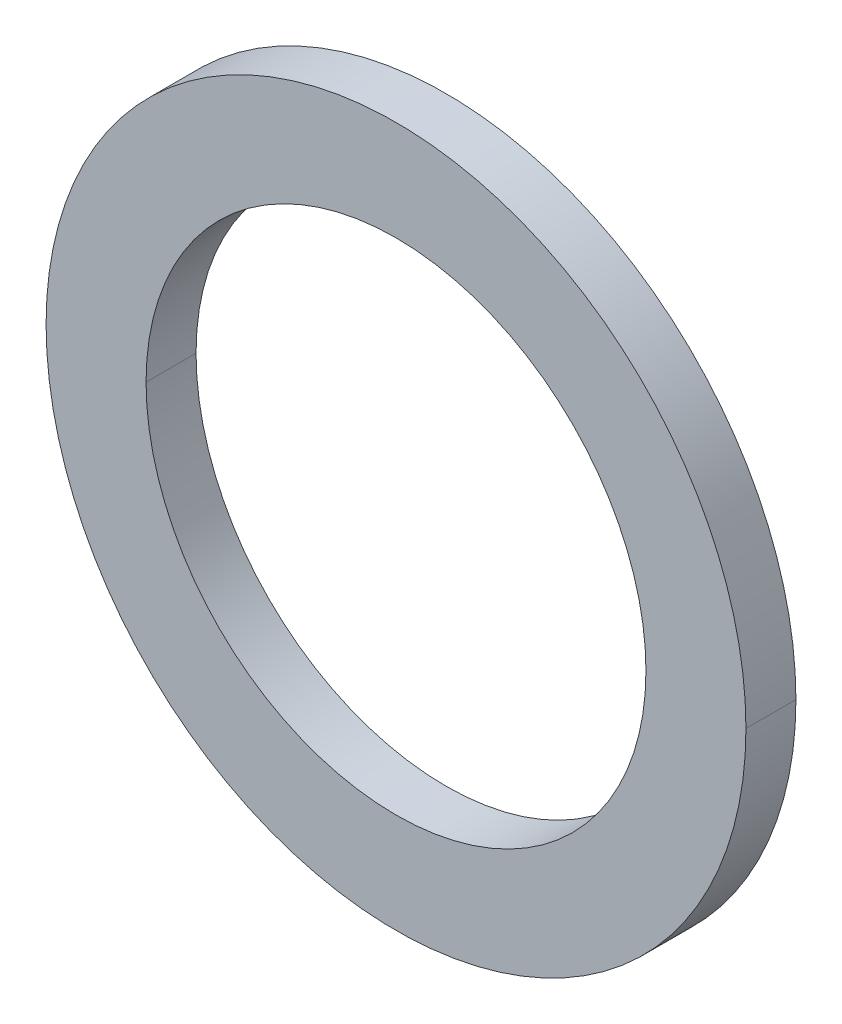
ISO-10303-21;
HEADER;
FILE_DESCRIPTION(('STEP AP214'),'2;1');
FILE_NAME('part.step','',(''),(''),'','','');
FILE_SCHEMA(('AUTOMOTIVE_DESIGN { 1 0 10303 214 1 1 1 1 }'));
ENDSEC;
DATA;
#1=APPLICATION_CONTEXT('core data for automotive mechanical design processes');
#2=APPLICATION_PROTOCOL_DEFINITION('international standard','automotive_design',2000,#1);
#3=PRODUCT_CONTEXT('',#1,'mechanical');
#4=PRODUCT('Part','Part','',(#3));
#5=PRODUCT_RELATED_PRODUCT_CATEGORY('part','',(#4));
#6=PRODUCT_DEFINITION_FORMATION('','',#4);
#7=PRODUCT_DEFINITION_CONTEXT('part definition',#1,'design');
#8=PRODUCT_DEFINITION('design','',#6,#7);
#9=PRODUCT_DEFINITION_SHAPE('','',#8);
#10=(LENGTH_UNIT() NAMED_UNIT(*) SI_UNIT(.MILLI.,.METRE.));
#11=(NAMED_UNIT(*) PLANE_ANGLE_UNIT() SI_UNIT($,.RADIAN.));
#12=(NAMED_UNIT(*) SI_UNIT($,.STERADIAN.) SOLID_ANGLE_UNIT());
#13=UNCERTAINTY_MEASURE_WITH_UNIT(LENGTH_MEASURE(1.E-05),#10,'distance_accuracy_value','');
#14=(GEOMETRIC_REPRESENTATION_CONTEXT(3) GLOBAL_UNCERTAINTY_ASSIGNED_CONTEXT((#13)) GLOBAL_UNIT_ASSIGNED_CONTEXT((#10,
#11,#12)) REPRESENTATION_CONTEXT('',''));
#15=CARTESIAN_POINT('',(0.,0.,0.));
#16=DIRECTION('',(0.,0.,1.));
#17=DIRECTION('',(1.,0.,0.));
#18=AXIS2_PLACEMENT_3D('',#15,#16,#17);
#19=CARTESIAN_POINT('',(0.,0.,0.5));
#20=DIRECTION('',(0.,0.,1.));
#21=DIRECTION('',(-1.,0.,0.));
#22=AXIS2_PLACEMENT_3D('',#19,#20,#21);
#23=PLANE('',#22);
#24=CARTESIAN_POINT('',(0.,0.,0.5));
#25=DIRECTION('',(0.,0.,-1.));
#26=DIRECTION('',(-1.,0.,0.));
#27=AXIS2_PLACEMENT_3D('',#24,#25,#26);
#28=CIRCLE('',#27,2.5);
#29=CARTESIAN_POINT('',(-2.5,0.,0.5));
#30=VERTEX_POINT('',#29);
#31=CARTESIAN_POINT('',(2.5,0.,0.5));
#32=VERTEX_POINT('',#31);
#33=EDGE_CURVE('E10',#30,#32,#28,.T.);
#34=ORIENTED_EDGE('',*,*,#33,.T.);
#35=CARTESIAN_POINT('',(0.,0.,0.5));
#36=DIRECTION('',(0.,0.,-1.));
#37=DIRECTION('',(1.,0.,0.));
#38=AXIS2_PLACEMENT_3D('',#35,#36,#37);
#39=CIRCLE('',#38,2.5);
#40=EDGE_CURVE('E24',#32,#30,#39,.T.);
#41=ORIENTED_EDGE('',*,*,#40,.T.);
#42=EDGE_LOOP('',(#34,#41));
#43=FACE_BOUND('',#42,.T.);
#44=CARTESIAN_POINT('',(0.,0.,0.5));
#45=DIRECTION('',(0.,0.,1.));
#46=DIRECTION('',(-1.,0.,0.));
#47=AXIS2_PLACEMENT_3D('',#44,#45,#46);
#48=CIRCLE('',#47,3.5);
#49=CARTESIAN_POINT('',(-3.5,0.,0.5));
#50=VERTEX_POINT('',#49);
#51=CARTESIAN_POINT('',(3.5,0.,0.5));
#52=VERTEX_POINT('',#51);
#53=EDGE_CURVE('E54',#50,#52,#48,.T.);
#54=ORIENTED_EDGE('',*,*,#53,.T.);
#55=CARTESIAN_POINT('',(0.,0.,0.5));
#56=DIRECTION('',(0.,0.,1.));
#57=DIRECTION('',(1.,0.,0.));
#58=AXIS2_PLACEMENT_3D('',#55,#56,#57);
#59=CIRCLE('',#58,3.5);
#60=EDGE_CURVE('E56',#52,#50,#59,.T.);
#61=ORIENTED_EDGE('',*,*,#60,.T.);
#62=EDGE_LOOP('',(#54,#61));
#63=FACE_BOUND('',#62,.T.);
#64=ADVANCED_FACE('F16',(#43,#63),#23,.T.);
#65=CARTESIAN_POINT('',(0.,0.,0.));
#66=DIRECTION('',(0.,0.,1.));
#67=DIRECTION('',(-1.,0.,0.));
#68=AXIS2_PLACEMENT_3D('',#65,#66,#67);
#69=CYLINDRICAL_SURFACE('',#68,2.5);
#70=ORIENTED_EDGE('',*,*,#33,.F.);
#71=DIRECTION('',(0.,0.,-1.));
#72=VECTOR('',#71,1.);
#73=CARTESIAN_POINT('',(-2.5,0.,0.5));
#74=LINE('',#73,#72);
#75=CARTESIAN_POINT('',(-2.5,0.,0.));
#76=VERTEX_POINT('',#75);
#77=EDGE_CURVE('E35',#30,#76,#74,.T.);
#78=ORIENTED_EDGE('',*,*,#77,.T.);
#79=CARTESIAN_POINT('',(0.,0.,0.));
#80=DIRECTION('',(0.,0.,1.));
#81=DIRECTION('',(1.,0.,0.));
#82=AXIS2_PLACEMENT_3D('',#79,#80,#81);
#83=CIRCLE('',#82,2.5);
#84=CARTESIAN_POINT('',(2.5,0.,0.));
#85=VERTEX_POINT('',#84);
#86=EDGE_CURVE('E88',#85,#76,#83,.T.);
#87=ORIENTED_EDGE('',*,*,#86,.F.);
#88=DIRECTION('',(0.,0.,-1.));
#89=VECTOR('',#88,1.);
#90=CARTESIAN_POINT('',(2.5,0.,0.5));
#91=LINE('',#90,#89);
#92=EDGE_CURVE('E92',#32,#85,#91,.T.);
#93=ORIENTED_EDGE('',*,*,#92,.F.);
#94=EDGE_LOOP('',(#70,#78,#87,#93));
#95=FACE_BOUND('',#94,.T.);
#96=ADVANCED_FACE('F107',(#95),#69,.F.);
#97=CARTESIAN_POINT('',(0.,0.,0.));
#98=DIRECTION('',(0.,0.,1.));
#99=DIRECTION('',(-1.,0.,0.));
#100=AXIS2_PLACEMENT_3D('',#97,#98,#99);
#101=CYLINDRICAL_SURFACE('',#100,2.5);
#102=ORIENTED_EDGE('',*,*,#40,.F.);
#103=ORIENTED_EDGE('',*,*,#92,.T.);
#104=CARTESIAN_POINT('',(0.,0.,0.));
#105=DIRECTION('',(0.,0.,1.));
#106=DIRECTION('',(-1.,0.,0.));
#107=AXIS2_PLACEMENT_3D('',#104,#105,#106);
#108=CIRCLE('',#107,2.5);
#109=EDGE_CURVE('E72',#76,#85,#108,.T.);
#110=ORIENTED_EDGE('',*,*,#109,.F.);
#111=ORIENTED_EDGE('',*,*,#77,.F.);
#112=EDGE_LOOP('',(#102,#103,#110,#111));
#113=FACE_BOUND('',#112,.T.);
#114=ADVANCED_FACE('F103',(#113),#101,.F.);
#115=CARTESIAN_POINT('',(0.,0.,0.));
#116=DIRECTION('',(0.,0.,1.));
#117=DIRECTION('',(-1.,0.,0.));
#118=AXIS2_PLACEMENT_3D('',#115,#116,#117);
#119=PLANE('',#118);
#120=ORIENTED_EDGE('',*,*,#86,.T.);
#121=ORIENTED_EDGE('',*,*,#109,.T.);
#122=EDGE_LOOP('',(#120,#121));
#123=FACE_BOUND('',#122,.T.);
#124=CARTESIAN_POINT('',(0.,0.,0.));
#125=DIRECTION('',(0.,0.,-1.));
#126=DIRECTION('',(1.,0.,0.));
#127=AXIS2_PLACEMENT_3D('',#124,#125,#126);
#128=CIRCLE('',#127,3.5);
#129=CARTESIAN_POINT('',(3.5,0.,0.));
#130=VERTEX_POINT('',#129);
#131=CARTESIAN_POINT('',(-3.5,0.,0.));
#132=VERTEX_POINT('',#131);
#133=EDGE_CURVE('E75',#130,#132,#128,.T.);
#134=ORIENTED_EDGE('',*,*,#133,.T.);
#135=CARTESIAN_POINT('',(0.,0.,0.));
#136=DIRECTION('',(0.,0.,-1.));
#137=DIRECTION('',(-1.,0.,0.));
#138=AXIS2_PLACEMENT_3D('',#135,#136,#137);
#139=CIRCLE('',#138,3.5);
#140=EDGE_CURVE('E62',#132,#130,#139,.T.);
#141=ORIENTED_EDGE('',*,*,#140,.T.);
#142=EDGE_LOOP('',(#134,#141));
#143=FACE_BOUND('',#142,.T.);
#144=ADVANCED_FACE('F105',(#123,#143),#119,.F.);
#145=CARTESIAN_POINT('',(0.,0.,0.));
#146=DIRECTION('',(0.,0.,1.));
#147=DIRECTION('',(-1.,0.,0.));
#148=AXIS2_PLACEMENT_3D('',#145,#146,#147);
#149=CYLINDRICAL_SURFACE('',#148,3.5);
#150=ORIENTED_EDGE('',*,*,#60,.F.);
#151=DIRECTION('',(0.,0.,-1.));
#152=VECTOR('',#151,1.);
#153=CARTESIAN_POINT('',(3.5,0.,0.5));
#154=LINE('',#153,#152);
#155=EDGE_CURVE('E69',#52,#130,#154,.T.);
#156=ORIENTED_EDGE('',*,*,#155,.T.);
#157=ORIENTED_EDGE('',*,*,#140,.F.);
#158=DIRECTION('',(0.,0.,-1.));
#159=VECTOR('',#158,1.);
#160=CARTESIAN_POINT('',(-3.5,0.,0.5));
#161=LINE('',#160,#159);
#162=EDGE_CURVE('E63',#50,#132,#161,.T.);
#163=ORIENTED_EDGE('',*,*,#162,.F.);
#164=EDGE_LOOP('',(#150,#156,#157,#163));
#165=FACE_BOUND('',#164,.T.);
#166=ADVANCED_FACE('F67',(#165),#149,.T.);
#167=CARTESIAN_POINT('',(0.,0.,0.));
#168=DIRECTION('',(0.,0.,1.));
#169=DIRECTION('',(-1.,0.,0.));
#170=AXIS2_PLACEMENT_3D('',#167,#168,#169);
#171=CYLINDRICAL_SURFACE('',#170,3.5);
#172=ORIENTED_EDGE('',*,*,#53,.F.);
#173=ORIENTED_EDGE('',*,*,#162,.T.);
#174=ORIENTED_EDGE('',*,*,#133,.F.);
#175=ORIENTED_EDGE('',*,*,#155,.F.);
#176=EDGE_LOOP('',(#172,#173,#174,#175));
#177=FACE_BOUND('',#176,.T.);
#178=ADVANCED_FACE('F74',(#177),#171,.T.);
#179=CLOSED_SHELL('',(#64,#96,#114,#144,#166,#178));
#180=MANIFOLD_SOLID_BREP('B1',#179);
#181=ADVANCED_BREP_SHAPE_REPRESENTATION('',(#18,#180),#14);
#182=SHAPE_DEFINITION_REPRESENTATION(#9,#181);
ENDSEC;
END-ISO-10303-21;
